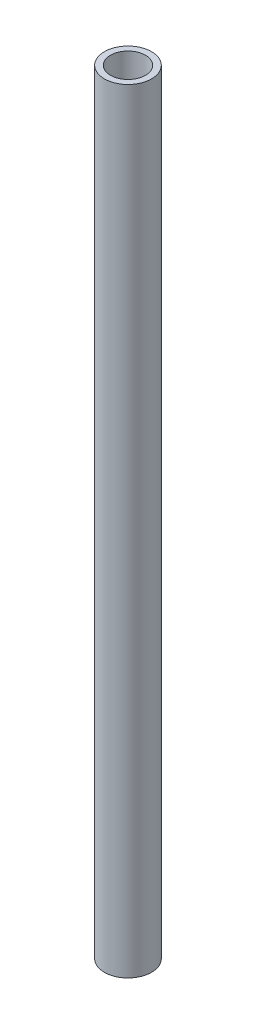
ISO-10303-21;
HEADER;
FILE_DESCRIPTION(('STEP AP214'),'2;1');
FILE_NAME('part.step','',(''),(''),'','','');
FILE_SCHEMA(('AUTOMOTIVE_DESIGN { 1 0 10303 214 1 1 1 1 }'));
ENDSEC;
DATA;
#1=APPLICATION_CONTEXT('core data for automotive mechanical design processes');
#2=APPLICATION_PROTOCOL_DEFINITION('international standard','automotive_design',2000,#1);
#3=PRODUCT_CONTEXT('',#1,'mechanical');
#4=PRODUCT('Part','Part','',(#3));
#5=PRODUCT_RELATED_PRODUCT_CATEGORY('part','',(#4));
#6=PRODUCT_DEFINITION_FORMATION('','',#4);
#7=PRODUCT_DEFINITION_CONTEXT('part definition',#1,'design');
#8=PRODUCT_DEFINITION('design','',#6,#7);
#9=PRODUCT_DEFINITION_SHAPE('','',#8);
#10=(LENGTH_UNIT() NAMED_UNIT(*) SI_UNIT(.MILLI.,.METRE.));
#11=(NAMED_UNIT(*) PLANE_ANGLE_UNIT() SI_UNIT($,.RADIAN.));
#12=(NAMED_UNIT(*) SI_UNIT($,.STERADIAN.) SOLID_ANGLE_UNIT());
#13=UNCERTAINTY_MEASURE_WITH_UNIT(LENGTH_MEASURE(1.E-05),#10,'distance_accuracy_value','');
#14=(GEOMETRIC_REPRESENTATION_CONTEXT(3) GLOBAL_UNCERTAINTY_ASSIGNED_CONTEXT((#13)) GLOBAL_UNIT_ASSIGNED_CONTEXT((#10,
#11,#12)) REPRESENTATION_CONTEXT('',''));
#15=CARTESIAN_POINT('',(0.,0.,0.));
#16=DIRECTION('',(0.,0.,1.));
#17=DIRECTION('',(1.,0.,0.));
#18=AXIS2_PLACEMENT_3D('',#15,#16,#17);
#19=CARTESIAN_POINT('',(0.,350.,0.));
#20=DIRECTION('',(0.,1.,0.));
#21=DIRECTION('',(0.,0.,1.));
#22=AXIS2_PLACEMENT_3D('',#19,#20,#21);
#23=PLANE('',#22);
#24=CARTESIAN_POINT('',(0.,350.,0.));
#25=DIRECTION('',(0.,1.,0.));
#26=DIRECTION('',(0.,0.,1.));
#27=AXIS2_PLACEMENT_3D('',#24,#25,#26);
#28=CIRCLE('',#27,10.668);
#29=CARTESIAN_POINT('',(0.,350.,10.668));
#30=VERTEX_POINT('',#29);
#31=EDGE_CURVE('E10',#30,#30,#28,.T.);
#32=ORIENTED_EDGE('',*,*,#31,.T.);
#33=EDGE_LOOP('',(#32));
#34=FACE_BOUND('',#33,.T.);
#35=CARTESIAN_POINT('',(0.,350.,0.));
#36=DIRECTION('',(0.,1.,0.));
#37=DIRECTION('',(0.,0.,1.));
#38=AXIS2_PLACEMENT_3D('',#35,#36,#37);
#39=CIRCLE('',#38,7.8994);
#40=CARTESIAN_POINT('',(0.,350.,7.8994));
#41=VERTEX_POINT('',#40);
#42=EDGE_CURVE('E43',#41,#41,#39,.T.);
#43=ORIENTED_EDGE('',*,*,#42,.F.);
#44=EDGE_LOOP('',(#43));
#45=FACE_BOUND('',#44,.T.);
#46=ADVANCED_FACE('F32',(#34,#45),#23,.T.);
#47=CARTESIAN_POINT('',(0.,0.,0.));
#48=DIRECTION('',(0.,1.,0.));
#49=DIRECTION('',(0.,0.,1.));
#50=AXIS2_PLACEMENT_3D('',#47,#48,#49);
#51=PLANE('',#50);
#52=CARTESIAN_POINT('',(0.,0.,0.));
#53=DIRECTION('',(0.,1.,0.));
#54=DIRECTION('',(0.,0.,1.));
#55=AXIS2_PLACEMENT_3D('',#52,#53,#54);
#56=CIRCLE('',#55,10.668);
#57=CARTESIAN_POINT('',(0.,0.,10.668));
#58=VERTEX_POINT('',#57);
#59=EDGE_CURVE('E36',#58,#58,#56,.T.);
#60=ORIENTED_EDGE('',*,*,#59,.F.);
#61=EDGE_LOOP('',(#60));
#62=FACE_BOUND('',#61,.T.);
#63=CARTESIAN_POINT('',(0.,0.,0.));
#64=DIRECTION('',(0.,1.,0.));
#65=DIRECTION('',(0.,0.,1.));
#66=AXIS2_PLACEMENT_3D('',#63,#64,#65);
#67=CIRCLE('',#66,7.8994);
#68=CARTESIAN_POINT('',(0.,0.,7.8994));
#69=VERTEX_POINT('',#68);
#70=EDGE_CURVE('E45',#69,#69,#67,.T.);
#71=ORIENTED_EDGE('',*,*,#70,.T.);
#72=EDGE_LOOP('',(#71));
#73=FACE_BOUND('',#72,.T.);
#74=ADVANCED_FACE('F55',(#62,#73),#51,.F.);
#75=CARTESIAN_POINT('',(0.,350.,0.));
#76=DIRECTION('',(0.,-1.,0.));
#77=DIRECTION('',(0.,0.,-1.));
#78=AXIS2_PLACEMENT_3D('',#75,#76,#77);
#79=CYLINDRICAL_SURFACE('',#78,10.668);
#80=ORIENTED_EDGE('',*,*,#31,.F.);
#81=EDGE_LOOP('',(#80));
#82=FACE_BOUND('',#81,.T.);
#83=ORIENTED_EDGE('',*,*,#59,.T.);
#84=EDGE_LOOP('',(#83));
#85=FACE_BOUND('',#84,.T.);
#86=ADVANCED_FACE('F34',(#82,#85),#79,.T.);
#87=CARTESIAN_POINT('',(0.,350.,0.));
#88=DIRECTION('',(0.,-1.,0.));
#89=DIRECTION('',(0.,0.,-1.));
#90=AXIS2_PLACEMENT_3D('',#87,#88,#89);
#91=CYLINDRICAL_SURFACE('',#90,7.8994);
#92=ORIENTED_EDGE('',*,*,#42,.T.);
#93=EDGE_LOOP('',(#92));
#94=FACE_BOUND('',#93,.T.);
#95=ORIENTED_EDGE('',*,*,#70,.F.);
#96=EDGE_LOOP('',(#95));
#97=FACE_BOUND('',#96,.T.);
#98=ADVANCED_FACE('F51',(#94,#97),#91,.F.);
#99=CLOSED_SHELL('',(#46,#74,#86,#98));
#100=MANIFOLD_SOLID_BREP('B2',#99);
#101=ADVANCED_BREP_SHAPE_REPRESENTATION('',(#18,#100),#14);
#102=SHAPE_DEFINITION_REPRESENTATION(#9,#101);
ENDSEC;
END-ISO-10303-21;
